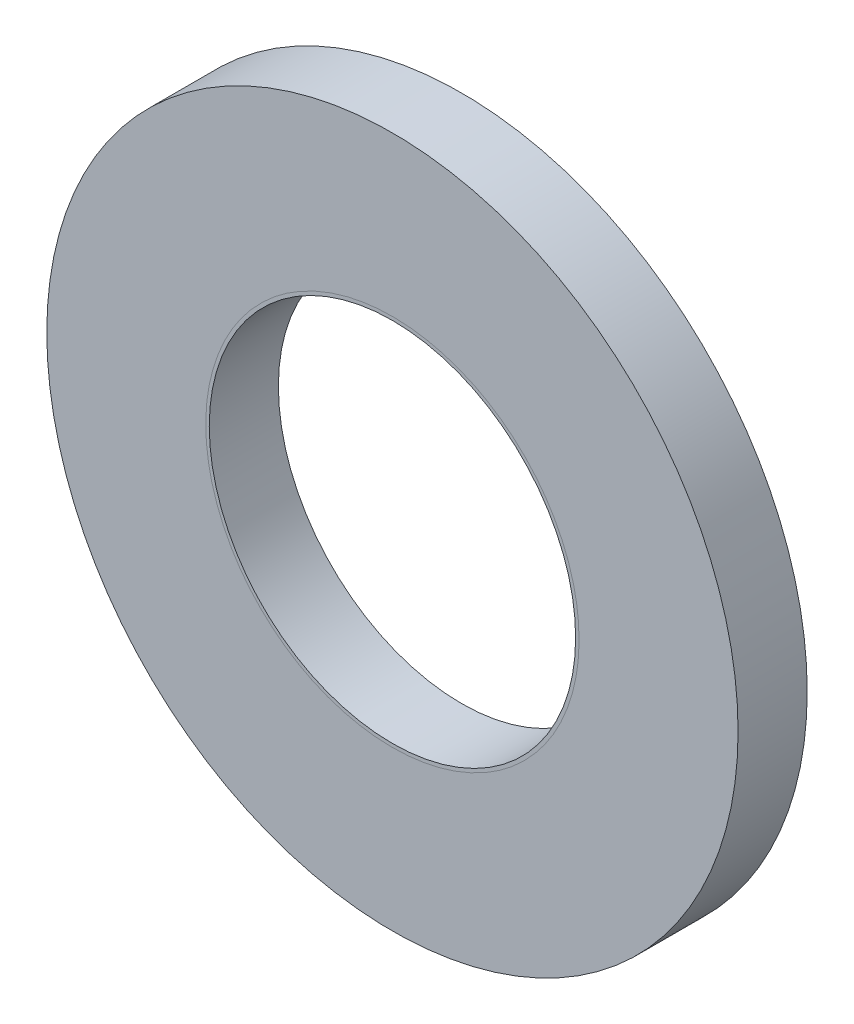
ISO-10303-21;
HEADER;
FILE_DESCRIPTION(('STEP AP214'),'2;1');
FILE_NAME('part.step','',(''),(''),'','','');
FILE_SCHEMA(('AUTOMOTIVE_DESIGN { 1 0 10303 214 1 1 1 1 }'));
ENDSEC;
DATA;
#1=APPLICATION_CONTEXT('core data for automotive mechanical design processes');
#2=APPLICATION_PROTOCOL_DEFINITION('international standard','automotive_design',2000,#1);
#3=PRODUCT_CONTEXT('',#1,'mechanical');
#4=PRODUCT('Part','Part','',(#3));
#5=PRODUCT_RELATED_PRODUCT_CATEGORY('part','',(#4));
#6=PRODUCT_DEFINITION_FORMATION('','',#4);
#7=PRODUCT_DEFINITION_CONTEXT('part definition',#1,'design');
#8=PRODUCT_DEFINITION('design','',#6,#7);
#9=PRODUCT_DEFINITION_SHAPE('','',#8);
#10=(LENGTH_UNIT() NAMED_UNIT(*) SI_UNIT(.MILLI.,.METRE.));
#11=(NAMED_UNIT(*) PLANE_ANGLE_UNIT() SI_UNIT($,.RADIAN.));
#12=(NAMED_UNIT(*) SI_UNIT($,.STERADIAN.) SOLID_ANGLE_UNIT());
#13=UNCERTAINTY_MEASURE_WITH_UNIT(LENGTH_MEASURE(1.E-05),#10,'distance_accuracy_value','');
#14=(GEOMETRIC_REPRESENTATION_CONTEXT(3) GLOBAL_UNCERTAINTY_ASSIGNED_CONTEXT((#13)) GLOBAL_UNIT_ASSIGNED_CONTEXT((#10,
#11,#12)) REPRESENTATION_CONTEXT('',''));
#15=CARTESIAN_POINT('',(0.,0.,0.));
#16=DIRECTION('',(0.,0.,1.));
#17=DIRECTION('',(1.,0.,0.));
#18=AXIS2_PLACEMENT_3D('',#15,#16,#17);
#19=CARTESIAN_POINT('',(0.,0.,1.1));
#20=DIRECTION('',(0.,0.,1.));
#21=DIRECTION('',(1.,0.,0.));
#22=AXIS2_PLACEMENT_3D('',#19,#20,#21);
#23=PLANE('',#22);
#24=CARTESIAN_POINT('',(-2.68972517592187,-0.235326322378775,1.09997841221976));
#25=CARTESIAN_POINT('',(-2.68600440242709,-0.277887764364603,1.09997841023913));
#26=CARTESIAN_POINT('',(-2.68130196476585,-0.320365171708397,1.09997840825841));
#27=CARTESIAN_POINT('',(-2.66994925084259,-0.404776140324443,1.09997840431423));
#28=CARTESIAN_POINT('',(-2.66331189641072,-0.446711441626157,1.09997840235073));
#29=CARTESIAN_POINT('',(-2.6480900029687,-0.530038714857837,1.09997839844096));
#30=CARTESIAN_POINT('',(-2.6395140874529,-0.571432259202987,1.09997839649464));
#31=CARTESIAN_POINT('',(-2.6204204341527,-0.653676066761412,1.09997839261927));
#32=CARTESIAN_POINT('',(-2.60990687901935,-0.694527300785542,1.09997839069017));
#33=CARTESIAN_POINT('',(-2.58694219375293,-0.775687236262533,1.09997838684921));
#34=CARTESIAN_POINT('',(-2.57449081215858,-0.815995866566043,1.09997838493735));
#35=CARTESIAN_POINT('',(-2.5476549853053,-0.896071649945949,1.09997838113081));
#36=CARTESIAN_POINT('',(-2.53326597805442,-0.935837273511998,1.0999783792362));
#37=CARTESIAN_POINT('',(-2.50255919675527,-1.01482878773208,1.0999783754641));
#38=CARTESIAN_POINT('',(-2.48623278873031,-1.05405132077825,1.09997837358674));
#39=CARTESIAN_POINT('',(-2.4516551065583,-1.13195776724211,1.09997836984911));
#40=CARTESIAN_POINT('',(-2.43339146441594,-1.17063618307302,1.09997836798905));
#41=CARTESIAN_POINT('',(-2.3935132174612,-1.25031708410015,1.09997836414806));
#42=CARTESIAN_POINT('',(-2.37174610289514,-1.29124335591321,1.09997836217003));
#43=CARTESIAN_POINT('',(-2.32633190468705,-1.37163070220461,1.09997835827405));
#44=CARTESIAN_POINT('',(-2.30270034380542,-1.41110053978221,1.09997835635575));
#45=CARTESIAN_POINT('',(-2.25356222362503,-1.4885767108033,1.09997835257916));
#46=CARTESIAN_POINT('',(-2.22806573611798,-1.52658942855752,1.09997835072062));
#47=CARTESIAN_POINT('',(-2.17520346993483,-1.60115394635506,1.09997834706346));
#48=CARTESIAN_POINT('',(-2.14784237419531,-1.63770906556622,1.0999783452647));
#49=CARTESIAN_POINT('',(-2.09125625312868,-1.70936156558717,1.09997834172698));
#50=CARTESIAN_POINT('',(-2.06203077135774,-1.74445858592174,1.09997833998803));
#51=CARTESIAN_POINT('',(-2.0017211287124,-1.81319880055702,1.09997833656976));
#52=CARTESIAN_POINT('',(-1.9706317901331,-1.84683745087662,1.09997833489063));
#53=CARTESIAN_POINT('',(-1.90659861244646,-1.91266481129962,1.09997833159183));
#54=CARTESIAN_POINT('',(-1.87364543197635,-1.94484443020998,1.09997832997255));
#55=CARTESIAN_POINT('',(-1.80589032088828,-2.00775977736999,1.09997832679321));
#56=CARTESIAN_POINT('',(-1.77107556573347,-2.03848168127963,1.09997832523373));
#57=CARTESIAN_POINT('',(-1.70002824719523,-2.09811642933317,1.09997832219259));
#58=CARTESIAN_POINT('',(-1.66379813928482,-2.12703219851057,1.0999783207108));
#59=CARTESIAN_POINT('',(-1.59019282137698,-2.18277087096662,1.09997831783926));
#60=CARTESIAN_POINT('',(-1.55282839079024,-2.20960799423028,1.09997831644889));
#61=CARTESIAN_POINT('',(-1.4769604296734,-2.26119470146773,1.09997831375995));
#62=CARTESIAN_POINT('',(-1.43846360541522,-2.28595414421612,1.09997831246096));
#63=CARTESIAN_POINT('',(-1.36033451016601,-2.33338966654442,1.0999783099546));
#64=CARTESIAN_POINT('',(-1.32070521928903,-2.35607065308044,1.09997830874701));
#65=CARTESIAN_POINT('',(-1.24031499359229,-2.39935439398233,1.09997830642326));
#66=CARTESIAN_POINT('',(-1.19955378304278,-2.41995663621232,1.09997830530711));
#67=CARTESIAN_POINT('',(-1.11690295815023,-2.45908869355478,1.09997830316595));
#68=CARTESIAN_POINT('',(-1.07501039645535,-2.47761228161771,1.09997830214123));
#69=CARTESIAN_POINT('',(-0.990099116819804,-2.51259165821764,1.09997830018272));
#70=CARTESIAN_POINT('',(-0.947075435967371,-2.52903538909286,1.09997829924948));
#71=CARTESIAN_POINT('',(-0.859904996347562,-2.55986517342414,1.09997829747348));
#72=CARTESIAN_POINT('',(-0.81575195936713,-2.57423345862157,1.09997829663153));
#73=CARTESIAN_POINT('',(-0.730344736181416,-2.5997014034968,1.09997829511028));
#74=CARTESIAN_POINT('',(-0.689140998077284,-2.61097054414516,1.09997829442337));
#75=CARTESIAN_POINT('',(-0.606513595071295,-2.63149191069137,1.0999782931418));
#76=CARTESIAN_POINT('',(-0.565093034989126,-2.64075660725406,1.09997829254658));
#77=CARTESIAN_POINT('',(-0.482035492916084,-2.65727675212489,1.09997829144806));
#78=CARTESIAN_POINT('',(-0.440400172641557,-2.66454055120152,1.09997829094438));
#79=CARTESIAN_POINT('',(-0.356914036337795,-2.67706212127447,1.09997829002879));
#80=CARTESIAN_POINT('',(-0.315063819365893,-2.68232388315743,1.0999782896167));
#81=CARTESIAN_POINT('',(-0.231149022793373,-2.69084605416584,1.09997828888409));
#82=CARTESIAN_POINT('',(-0.189084389674092,-2.69410593619615,1.09997828856358));
#83=CARTESIAN_POINT('',(-0.104741315204051,-2.69862898418623,1.09997828801392));
#84=CARTESIAN_POINT('',(-0.0624626021682738,-2.69988707369687,1.099978287785));
#85=CARTESIAN_POINT('',(0.0223085074702332,-2.70041056062237,1.09997828741833));
#86=CARTESIAN_POINT('',(0.0648009610846119,-2.69966642114691,1.09997828728101));
#87=CARTESIAN_POINT('',(0.149999767942916,-2.69619191856139,1.09997828709725));
#88=CARTESIAN_POINT('',(0.192705554307764,-2.69344778195152,1.09997828705143));
#89=CARTESIAN_POINT('',(0.277870085786983,-2.68601004899264,1.09997828705084));
#90=CARTESIAN_POINT('',(0.320329136340919,-2.68131995241243,1.09997828709589));
#91=CARTESIAN_POINT('',(0.40470912716513,-2.66998513265859,1.09997828727844));
#92=CARTESIAN_POINT('',(0.446631772140297,-2.66335313779257,1.09997828741535));
#93=CARTESIAN_POINT('',(0.529938723417316,-2.6481408081846,1.09997828778131));
#94=CARTESIAN_POINT('',(0.571324558476903,-2.6395688522093,1.09997828800997));
#95=CARTESIAN_POINT('',(0.653558152701219,-2.62048049270148,1.09997828855927));
#96=CARTESIAN_POINT('',(0.694406824013564,-2.60996802053118,1.09997828887973));
#97=CARTESIAN_POINT('',(0.775566797398587,-2.58700327549276,1.09997828961239));
#98=CARTESIAN_POINT('',(0.815877955222623,-2.57455049285515,1.09997829002462));
#99=CARTESIAN_POINT('',(0.895963997067971,-2.54770956023395,1.09997829094063));
#100=CARTESIAN_POINT('',(0.935737264775804,-2.53331658965337,1.09997829144464));
#101=CARTESIAN_POINT('',(1.01474923764573,-2.50259951658344,1.099978292544));
#102=CARTESIAN_POINT('',(1.05398448634706,-2.48626652685788,1.09997829313978));
#103=CARTESIAN_POINT('',(1.13192170699492,-2.45167363007057,1.09997829442248));
#104=CARTESIAN_POINT('',(1.17061807429089,-2.43340111478925,1.09997829511001));
#105=CARTESIAN_POINT('',(1.25031659000728,-2.39351332008088,1.09997829663013));
#106=CARTESIAN_POINT('',(1.29124297378724,-2.37174642850081,1.09997829747003));
#107=CARTESIAN_POINT('',(1.37163040131962,-2.32633239208702,1.09997829924258));
#108=CARTESIAN_POINT('',(1.41110020924788,-2.30270077215774,1.09997830017448));
#109=CARTESIAN_POINT('',(1.48857635869076,-2.25356260900363,1.09997830213078));
#110=CARTESIAN_POINT('',(1.52658908432636,-2.22806613719264,1.09997830315469));
#111=CARTESIAN_POINT('',(1.60115360787774,-2.17520388246848,1.09997830529474));
#112=CARTESIAN_POINT('',(1.63770872498557,-2.14784278254013,1.09997830641066));
#113=CARTESIAN_POINT('',(1.70936122346613,-2.09125665840574,1.09997830873445));
#114=CARTESIAN_POINT('',(1.74445824436427,-2.06203117775717,1.09997830994236));
#115=CARTESIAN_POINT('',(1.8131984594136,-2.0017215359364,1.09997831244989));
#116=CARTESIAN_POINT('',(1.84683710958159,-1.97063219705513,1.09997831374976));
#117=CARTESIAN_POINT('',(1.91266446989286,-1.90659901914594,1.09997831644102));
#118=CARTESIAN_POINT('',(1.94484408884417,-1.87364583875737,1.09997831783287));
#119=CARTESIAN_POINT('',(2.00775943603444,-1.80589072772949,1.09997832070778));
#120=CARTESIAN_POINT('',(2.03848133993296,-1.7710759725525,1.09997832219149));
#121=CARTESIAN_POINT('',(2.09811608797838,-1.70002865399799,1.0999783252317));
#122=CARTESIAN_POINT('',(2.12703185715878,-1.66379854609345,1.09997832678807));
#123=CARTESIAN_POINT('',(2.18277052961701,-1.59019322818982,1.09997832996216));
#124=CARTESIAN_POINT('',(2.2096076528799,-1.55282879760148,1.09997833157931));
#125=CARTESIAN_POINT('',(2.26119436011679,-1.47696083648343,1.09997833487467));
#126=CARTESIAN_POINT('',(2.2859538028654,-1.43846401222565,1.09997833655252));
#127=CARTESIAN_POINT('',(2.33338932519386,-1.36033491697671,1.09997833996907));
#128=CARTESIAN_POINT('',(2.35607031172982,-1.32070562609962,1.09997834170761));
#129=CARTESIAN_POINT('',(2.39935405263168,-1.2403154004028,1.09997834524537));
#130=CARTESIAN_POINT('',(2.41995629486168,-1.19955418985333,1.09997834704459));
#131=CARTESIAN_POINT('',(2.45908835220414,-1.11690336496083,1.09997835070351));
#132=CARTESIAN_POINT('',(2.47761194026706,-1.07501080326597,1.09997835256338));
#133=CARTESIAN_POINT('',(2.51259131686697,-0.990099523630469,1.09997835634348));
#134=CARTESIAN_POINT('',(2.52903504774219,-0.947075842778076,1.09997835826398));
#135=CARTESIAN_POINT('',(2.55986483207344,-0.859905403158359,1.09997836216518));
#136=CARTESIAN_POINT('',(2.57423311727085,-0.815752366177978,1.09997836414623));
#137=CARTESIAN_POINT('',(2.59970106214609,-0.730345142992226,1.09997836798766));
#138=CARTESIAN_POINT('',(2.61097020279448,-0.689141404888004,1.09997836984503));
#139=CARTESIAN_POINT('',(2.63149156934073,-0.606514001881861,1.09997837357806));
#140=CARTESIAN_POINT('',(2.64075626590344,-0.565093441799627,1.09997837545354));
#141=CARTESIAN_POINT('',(2.6572764107743,-0.482035899726483,1.09997837922261));
#142=CARTESIAN_POINT('',(2.66454020985095,-0.440400579451918,1.09997838111609));
#143=CARTESIAN_POINT('',(2.67706177992391,-0.356914443148105,1.0999783849211));
#144=CARTESIAN_POINT('',(2.68232354180688,-0.31506422617619,1.0999783868326));
#145=CARTESIAN_POINT('',(2.69084571281528,-0.23114942960367,1.09997839067357));
#146=CARTESIAN_POINT('',(2.69410559484559,-0.189084796484402,1.09997839260305));
#147=CARTESIAN_POINT('',(2.69862864283566,-0.104741722014412,1.09997839647996));
#148=CARTESIAN_POINT('',(2.69988673234628,-0.0624630089786744,1.09997839842742));
#149=CARTESIAN_POINT('',(2.70041021927176,0.0223081006597296,1.09997840234026));
#150=CARTESIAN_POINT('',(2.69966607979628,0.0648005542740444,1.09997840430567));
#151=CARTESIAN_POINT('',(2.69619157721071,0.149999361132194,1.09997840825442));
#152=CARTESIAN_POINT('',(2.6934474406008,0.192705147496952,1.09997841023777));
#153=CARTESIAN_POINT('',(2.68600970764185,0.277869678976357,1.09997841420094));
#154=CARTESIAN_POINT('',(2.68131961106157,0.320328729530568,1.09997841618076));
#155=CARTESIAN_POINT('',(2.66998479130763,0.40470872035525,1.09997842012344));
#156=CARTESIAN_POINT('',(2.66335279644158,0.446631365330613,1.09997842208633));
#157=CARTESIAN_POINT('',(2.64814046683354,0.529938316607946,1.09997842599513));
#158=CARTESIAN_POINT('',(2.63956851085821,0.57132415166765,1.09997842794107));
#159=CARTESIAN_POINT('',(2.62048015135035,0.653557745892124,1.09997843181595));
#160=CARTESIAN_POINT('',(2.60996767918005,0.69440641720451,1.09997843374492));
#161=CARTESIAN_POINT('',(2.58700293414164,0.775566390589533,1.09997843758589));
#162=CARTESIAN_POINT('',(2.57455015150403,0.81587754841353,1.09997843949787));
#163=CARTESIAN_POINT('',(2.54770921888286,0.895963590258721,1.0999784433049));
#164=CARTESIAN_POINT('',(2.53331624830231,0.935736857966436,1.09997844519989));
#165=CARTESIAN_POINT('',(2.50259917523245,1.01474883083604,1.09997844897297));
#166=CARTESIAN_POINT('',(2.48626618550693,1.05398407953719,1.09997845085095));
#167=CARTESIAN_POINT('',(2.45167328871972,1.13192130018457,1.09997845459006));
#168=CARTESIAN_POINT('',(2.43340077343845,1.17061766748026,1.09997845645098));
#169=CARTESIAN_POINT('',(2.39351297873004,1.25031618319643,1.09997846029283));
#170=CARTESIAN_POINT('',(2.37174608714985,1.29124256697643,1.09997846227086));
#171=CARTESIAN_POINT('',(2.32633205073587,1.37162999450889,1.09997846616684));
#172=CARTESIAN_POINT('',(2.30270043080651,1.41109980243719,1.09997846808514));
#173=CARTESIAN_POINT('',(2.25356226765228,1.48857595188012,1.09997847186172));
#174=CARTESIAN_POINT('',(2.22806579584124,1.52658867751574,1.09997847372026));
#175=CARTESIAN_POINT('',(2.17520354111702,1.60115320106715,1.09997847737743));
#176=CARTESIAN_POINT('',(2.14784244118865,1.63770831817499,1.09997847917619));
#177=CARTESIAN_POINT('',(2.09125631705426,1.70936081665555,1.09997848271391));
#178=CARTESIAN_POINT('',(2.06203083640571,1.74445783755368,1.09997848445286));
#179=CARTESIAN_POINT('',(2.001721194585,1.81319805260298,1.09997848787113));
#180=CARTESIAN_POINT('',(1.97063185570378,1.84683670277095,1.09997848955026));
#181=CARTESIAN_POINT('',(1.90659867779471,1.91266406308216,1.09997849284905));
#182=CARTESIAN_POINT('',(1.87364549740622,1.94484368203344,1.09997849446833));
#183=CARTESIAN_POINT('',(1.80589038637853,2.00775902922363,1.09997849764768));
#184=CARTESIAN_POINT('',(1.77107563120165,2.0384809331221,1.09997849920716));
#185=CARTESIAN_POINT('',(1.70002831264734,2.09811568116746,1.0999785022483));
#186=CARTESIAN_POINT('',(1.66379820474288,2.12703145034783,1.09997850373008));
#187=CARTESIAN_POINT('',(1.59019288683939,2.18277012280602,1.09997850660163));
#188=CARTESIAN_POINT('',(1.5528284562511,2.20960724606889,1.099978507992));
#189=CARTESIAN_POINT('',(1.47696049513316,2.26119395330576,1.09997851068094));
#190=CARTESIAN_POINT('',(1.4384636708754,2.28595339605435,1.09997851197993));
#191=CARTESIAN_POINT('',(1.36033457562652,2.3333889183828,1.09997851448629));
#192=CARTESIAN_POINT('',(1.32070528474943,2.35606990491876,1.09997851569387));
#193=CARTESIAN_POINT('',(1.24031505905261,2.39935364582061,1.09997851801763));
#194=CARTESIAN_POINT('',(1.19955384850313,2.41995588805062,1.09997851913378));
#195=CARTESIAN_POINT('',(1.11690302361058,2.4590879453931,1.09997852127494));
#196=CARTESIAN_POINT('',(1.07501046191568,2.47761153345602,1.09997852229966));
#197=CARTESIAN_POINT('',(0.990099182280092,2.51259091005596,1.09997852425817));
#198=CARTESIAN_POINT('',(0.94707550142764,2.52903464093119,1.09997852519141));
#199=CARTESIAN_POINT('',(0.859905061807782,2.55986442526249,1.0999785269674));
#200=CARTESIAN_POINT('',(0.815752024827321,2.57423271045993,1.09997852780936));
#201=CARTESIAN_POINT('',(0.730344801641563,2.59970065533517,1.09997852933061));
#202=CARTESIAN_POINT('',(0.689141063537418,2.61096979598353,1.09997853001752));
#203=CARTESIAN_POINT('',(0.606513660531406,2.63149116252975,1.09997853129909));
#204=CARTESIAN_POINT('',(0.565093100449226,2.64075585909243,1.09997853189431));
#205=CARTESIAN_POINT('',(0.482035558376169,2.65727600396327,1.09997853299283));
#206=CARTESIAN_POINT('',(0.440400238101637,2.66453980303991,1.09997853349651));
#207=CARTESIAN_POINT('',(0.356914101797868,2.67706137311286,1.0999785344121));
#208=CARTESIAN_POINT('',(0.315063884825964,2.68232313499582,1.09997853482419));
#209=CARTESIAN_POINT('',(0.231149088253444,2.69084530600423,1.0999785355568));
#210=CARTESIAN_POINT('',(0.189084455134165,2.69410518803453,1.09997853587731));
#211=CARTESIAN_POINT('',(0.104741380664131,2.69862823602462,1.09997853642696));
#212=CARTESIAN_POINT('',(0.0624626676283602,2.69988632553525,1.09997853665588));
#213=CARTESIAN_POINT('',(-0.0223084420101313,2.70040981246075,1.09997853702256));
#214=CARTESIAN_POINT('',(-0.0648008956245002,2.69966567298529,1.09997853715988));
#215=CARTESIAN_POINT('',(-0.14999970248278,2.69619117039976,1.09997853734364));
#216=CARTESIAN_POINT('',(-0.192705488847615,2.69344703378987,1.09997853738945));
#217=CARTESIAN_POINT('',(-0.277870020327062,2.68600930083098,1.09997853739005));
#218=CARTESIAN_POINT('',(-0.320329070881241,2.68131920425074,1.099978537345));
#219=CARTESIAN_POINT('',(-0.404709061705867,2.66998438449685,1.09997853716245));
#220=CARTESIAN_POINT('',(-0.446631706681208,2.66335238963082,1.09997853702554));
#221=CARTESIAN_POINT('',(-0.529938657958504,2.64814006002281,1.09997853665958));
#222=CARTESIAN_POINT('',(-0.571324493018194,2.63956810404751,1.09997853643092));
#223=CARTESIAN_POINT('',(-0.65355808724265,2.62047974453966,1.09997853588161));
#224=CARTESIAN_POINT('',(-0.694406758555031,2.60996727236937,1.09997853556116));
#225=CARTESIAN_POINT('',(-0.775566731940054,2.58700252733095,1.0999785348285));
#226=CARTESIAN_POINT('',(-0.815877889764055,2.57454974469334,1.09997853441627));
#227=CARTESIAN_POINT('',(-0.895963931609265,2.54770881207215,1.09997853350025));
#228=CARTESIAN_POINT('',(-0.935737199316995,2.53331584149159,1.09997853299625));
#229=CARTESIAN_POINT('',(-1.01474917218664,2.50259876842169,1.09997853189688));
#230=CARTESIAN_POINT('',(-1.05398442088781,2.48626577869615,1.0999785313011));
#231=CARTESIAN_POINT('',(-1.13192164153524,2.45167288190888,1.0999785300184));
#232=CARTESIAN_POINT('',(-1.17061800883097,2.43340036662757,1.09997852933088));
#233=CARTESIAN_POINT('',(-1.25031652454738,2.39351257191901,1.09997852781076));
#234=CARTESIAN_POINT('',(-1.29124290832758,2.37174568033871,1.09997852697086));
#235=CARTESIAN_POINT('',(-1.37163033586038,2.32633164392452,1.09997852519831));
#236=CARTESIAN_POINT('',(-1.41110014378882,2.30270002399508,1.09997852426641));
#237=CARTESIAN_POINT('',(-1.488576293232,2.25356186084071,1.09997852231011));
#238=CARTESIAN_POINT('',(-1.52658901886772,2.22806538902963,1.0999785212862));
#239=CARTESIAN_POINT('',(-1.60115354241922,2.17520313430533,1.09997851914615));
#240=CARTESIAN_POINT('',(-1.63770865952705,2.14784203437694,1.09997851803023));
#241=CARTESIAN_POINT('',(-1.7093611580077,2.09125591024257,1.09997851570643));
#242=CARTESIAN_POINT('',(-1.74445817890592,2.06203042959408,1.09997851449853));
#243=CARTESIAN_POINT('',(-1.81319839395478,2.00172078777334,1.099978511991));
#244=CARTESIAN_POINT('',(-1.84683704412222,1.97063144889204,1.09997851069113));
#245=CARTESIAN_POINT('',(-1.91266440443443,1.90659827098347,1.09997850799987));
#246=CARTESIAN_POINT('',(-1.94484402338726,1.87364509059558,1.09997850660802));
#247=CARTESIAN_POINT('',(-2.00775937057246,1.8058899795667,1.09997850373311));
#248=CARTESIAN_POINT('',(-2.03848127446434,1.77107522438801,1.0999785022494));
#249=CARTESIAN_POINT('',(-2.09811602252686,1.70002790583898,1.09997849920919));
#250=CARTESIAN_POINT('',(-2.12703179173095,1.66379779794158,1.09997849765282));
#251=CARTESIAN_POINT('',(-2.18277046412436,1.59019248001857,1.09997849447873));
#252=CARTESIAN_POINT('',(-2.20960758729958,1.55282804940394,1.09997849286157));
#253=CARTESIAN_POINT('',(-2.26119429477545,1.47696008835767,1.09997848956622));
#254=CARTESIAN_POINT('',(-2.2859537378486,1.4384632641973,1.09997848788837));
#255=CARTESIAN_POINT('',(-2.33338925929049,1.36033416868231,1.09997848447182));
#256=CARTESIAN_POINT('',(-2.35607024461907,1.32070487744286,1.09997848273327));
#257=CARTESIAN_POINT('',(-2.39935398882153,1.24031465273662,1.09997847919552));
#258=CARTESIAN_POINT('',(-2.41995623556093,1.1995534435405,1.0999784773963));
#259=CARTESIAN_POINT('',(-2.45908828056567,1.11690261494519,1.09997847373738));
#260=CARTESIAN_POINT('',(-2.47761185171907,1.07501004817543,1.09997847187751));
#261=CARTESIAN_POINT('',(-2.51259127462216,0.990098782436375,1.09997846809741));
#262=CARTESIAN_POINT('',(-2.52903506915566,0.947075120689038,1.09997846617691));
#263=CARTESIAN_POINT('',(-2.55986467903472,0.85990462871277,1.09997846227571));
#264=CARTESIAN_POINT('',(-2.57423272367026,0.815751519535072,1.09997846029465));
#265=CARTESIAN_POINT('',(-2.59970702746828,0.730325274066588,1.09997845645237));
#266=CARTESIAN_POINT('',(-2.61098180308535,0.689102298563496,1.09997845459414));
#267=CARTESIAN_POINT('',(-2.63151283311382,0.606441914949298,1.09997845085962));
#268=CARTESIAN_POINT('',(-2.64078181500663,0.565007675862126,1.09997844898353));
#269=CARTESIAN_POINT('',(-2.65730855397519,0.481928179856724,1.09997844521347));
#270=CARTESIAN_POINT('',(-2.66457492915117,0.440284638150804,1.09997844331962));
#271=CARTESIAN_POINT('',(-2.67709976902477,0.356787494768197,1.09997843951411));
#272=CARTESIAN_POINT('',(-2.68236249475921,0.314934532817133,1.09997843760249));
#273=CARTESIAN_POINT('',(-2.69088466084803,0.231019715505182,1.09997843376152));
#274=CARTESIAN_POINT('',(-2.69414384117215,0.188957833743453,1.09997843183216));
#275=CARTESIAN_POINT('',(-2.69866365547265,0.104625645919261,1.09997842795574));
#276=CARTESIAN_POINT('',(-2.69991947097785,0.0623550819046926,1.09997842600865));
#277=CARTESIAN_POINT('',(-2.70043625173286,-0.022393953699108,1.09997842209681));
#278=CARTESIAN_POINT('',(-2.69968792177555,-0.0648724788010867,1.09997842013202));
#279=CARTESIAN_POINT('',(-2.6962041660878,-0.150039065817644,1.09997841618473));
#280=CARTESIAN_POINT('',(-2.69345519659559,-0.19272657601528,1.0999784142022));
#281=CARTESIAN_POINT('',(-2.68972517592187,-0.235326322378775,1.09997841221976));
#282=B_SPLINE_CURVE_WITH_KNOTS('',3,(#24,#25,#26,#27,#28,#29,#30,#31,#32,#33,#34,#35,#36,#37,
#38,#39,#40,#41,#42,#43,#44,#45,#46,#47,#48,#49,#50,#51,#52,#53,#54,#55,#56,#57,#58,#59,#60,#61,
#62,#63,#64,#65,#66,#67,#68,#69,#70,#71,#72,#73,#74,#75,#76,#77,#78,#79,#80,#81,#82,#83,#84,#85,
#86,#87,#88,#89,#90,#91,#92,#93,#94,#95,#96,#97,#98,#99,#100,#101,#102,#103,#104,#105,#106,#107,
#108,#109,#110,#111,#112,#113,#114,#115,#116,#117,#118,#119,#120,#121,#122,#123,#124,#125,#126,
#127,#128,#129,#130,#131,#132,#133,#134,#135,#136,#137,#138,#139,#140,#141,#142,#143,#144,#145,
#146,#147,#148,#149,#150,#151,#152,#153,#154,#155,#156,#157,#158,#159,#160,#161,#162,#163,#164,
#165,#166,#167,#168,#169,#170,#171,#172,#173,#174,#175,#176,#177,#178,#179,#180,#181,#182,#183,
#184,#185,#186,#187,#188,#189,#190,#191,#192,#193,#194,#195,#196,#197,#198,#199,#200,#201,#202,
#203,#204,#205,#206,#207,#208,#209,#210,#211,#212,#213,#214,#215,#216,#217,#218,#219,#220,#221,
#222,#223,#224,#225,#226,#227,#228,#229,#230,#231,#232,#233,#234,#235,#236,#237,#238,#239,#240,
#241,#242,#243,#244,#245,#246,#247,#248,#249,#250,#251,#252,#253,#254,#255,#256,#257,#258,#259,
#260,#261,#262,#263,#264,#265,#266,#267,#268,#269,#270,#271,#272,#273,#274,#275,#276,#277,#278,
#279,#280,#281),.UNSPECIFIED.,.F.,.F.,(4,2,2,2,2,2,2,2,2,2,2,2,2,2,2,2,2,2,2,2,2,2,2,2,2,2,2,2,
2,2,2,2,2,2,2,2,2,2,2,2,2,2,2,2,2,2,2,2,2,2,2,2,2,2,2,2,2,2,2,2,2,2,2,2,2,2,2,2,2,2,2,2,2,2,2,2,
2,2,2,2,2,2,2,2,2,2,2,2,2,2,2,2,2,2,2,2,2,2,2,2,2,2,2,2,2,2,2,2,2,2,2,2,2,2,2,2,2,2,2,2,2,2,2,2,
2,2,2,2,4),(0.,0.128162595838292,0.255488166951852,0.382258116210694,0.508757554545793,
0.635273421738065,0.762092546053131,0.889499707629625,1.01777577023769,1.1567813965332,
1.29473198062754,1.43198588909148,1.56890695887909,1.70586167964997,1.84321627170126,
1.98133377457551,2.12057126043817,2.25957706949646,2.39752774752967,2.53478168996586,
2.67170276352763,2.80865748810085,2.94601211418647,3.08412971103025,3.2233673795516,
3.35147350182347,3.47875810336838,3.60550314261302,3.73199418621523,3.85851852065646,
3.9853632062203,4.11281313859199,4.24114918272255,4.36925541079188,4.49654006820778,
4.62328512895435,4.74977617567565,4.87630051106014,5.00314521160045,5.13059518897457,
5.25893132370289,5.39793694999835,5.53588753409265,5.67314144255656,5.81006251234415,
5.94701723311505,6.08437182516637,6.22248932804067,6.36172681390341,6.50073262296186,
6.63868330099518,6.77593724343143,6.91285831699323,7.04981304156642,7.18716766765198,
7.32528526449564,7.46452293301683,7.59262905528898,7.71991365683409,7.84665869607885,
7.97314973968109,8.09967407412229,8.22651875968601,8.35396869205751,8.4823047361878,
8.61041096425797,8.73769562167448,8.8644406824214,8.99093172914282,9.1174560645272,
9.24430076506714,9.37175074244067,9.50008687716817,9.63909250346392,9.77704308755842,
9.91429699602247,10.0512180658101,10.188172786581,10.3255273786321,10.4636448815062,
10.6028823673686,10.7418881764268,10.8798388544599,11.0170927968961,11.1540138704579,
11.2909685950311,11.4283232211167,11.5664408179606,11.705678486482,11.833784608754,
11.9610692102989,12.0878142495435,12.2143052931458,12.340829627587,12.4676743131508,
12.5951242455225,12.723460289653,12.8515665177231,12.9788511751395,13.1055962358864,
13.2320872826078,13.3586116179921,13.4854563185322,13.6129062959058,13.7412424306334,
13.8802480569298,14.0181986410249,14.1554525494892,14.2923736192769,14.4293283400477,
14.5666829320986,14.7048004349722,14.8440379208339,14.9830437298922,15.1209944079254,
15.2582483503615,15.3951694239233,15.5321241484965,15.6694787745821,15.8075963714259,
15.9468340399472,16.0750002982619,16.2023277606187,16.3290984024327,16.4555979227381,
16.582113857327,16.7089336303444,16.8363426096485,16.9646222309541),.UNSPECIFIED.);
#283=CARTESIAN_POINT('',(-2.68972517592187,-0.235326322378775,1.09997841221976));
#284=VERTEX_POINT('',#283);
#285=EDGE_CURVE('E38',#284,#284,#282,.T.);
#286=ORIENTED_EDGE('',*,*,#285,.F.);
#287=EDGE_LOOP('',(#286));
#288=FACE_BOUND('',#287,.T.);
#289=CARTESIAN_POINT('',(0.,0.,1.1));
#290=DIRECTION('',(0.,0.,-1.));
#291=DIRECTION('',(-1.,0.,0.));
#292=AXIS2_PLACEMENT_3D('',#289,#290,#291);
#293=CIRCLE('',#292,5.);
#294=CARTESIAN_POINT('',(-5.,0.,1.1));
#295=VERTEX_POINT('',#294);
#296=EDGE_CURVE('E19',#295,#295,#293,.T.);
#297=ORIENTED_EDGE('',*,*,#296,.F.);
#298=EDGE_LOOP('',(#297));
#299=FACE_BOUND('',#298,.T.);
#300=ADVANCED_FACE('F15',(#288,#299),#23,.T.);
#301=CARTESIAN_POINT('',(10.0860717384532,3.3449090095478,1.09997852594638));
#302=DIRECTION('',(4.04029452445734E-09,-4.6182607216144E-08,0.999999999999999));
#303=DIRECTION('',(0.,-0.999999999999999,-4.6182607216144E-08));
#304=AXIS2_PLACEMENT_3D('',#301,#302,#303);
#305=PLANE('',#304);
#306=CARTESIAN_POINT('',(0.,0.,1.09997854021043));
#307=DIRECTION('',(0.,0.,-1.));
#308=DIRECTION('',(-1.,0.,0.));
#309=AXIS2_PLACEMENT_3D('',#306,#307,#308);
#310=CIRCLE('',#309,2.65);
#311=CARTESIAN_POINT('',(-2.65,0.,1.09997854021043));
#312=VERTEX_POINT('',#311);
#313=EDGE_CURVE('E28',#312,#312,#310,.T.);
#314=ORIENTED_EDGE('',*,*,#313,.T.);
#315=EDGE_LOOP('',(#314));
#316=FACE_BOUND('',#315,.T.);
#317=ORIENTED_EDGE('',*,*,#285,.T.);
#318=EDGE_LOOP('',(#317));
#319=FACE_BOUND('',#318,.T.);
#320=ADVANCED_FACE('F45',(#316,#319),#305,.T.);
#321=CARTESIAN_POINT('',(0.,0.,1.1));
#322=DIRECTION('',(0.,0.,-1.));
#323=DIRECTION('',(-1.,0.,0.));
#324=AXIS2_PLACEMENT_3D('',#321,#322,#323);
#325=CYLINDRICAL_SURFACE('',#324,5.);
#326=ORIENTED_EDGE('',*,*,#296,.T.);
#327=EDGE_LOOP('',(#326));
#328=FACE_BOUND('',#327,.T.);
#329=CARTESIAN_POINT('',(0.,0.,0.1));
#330=DIRECTION('',(0.,0.,-1.));
#331=DIRECTION('',(-1.,0.,0.));
#332=AXIS2_PLACEMENT_3D('',#329,#330,#331);
#333=CIRCLE('',#332,5.);
#334=CARTESIAN_POINT('',(-5.,0.,0.1));
#335=VERTEX_POINT('',#334);
#336=EDGE_CURVE('E23',#335,#335,#333,.F.);
#337=ORIENTED_EDGE('',*,*,#336,.T.);
#338=EDGE_LOOP('',(#337));
#339=FACE_BOUND('',#338,.T.);
#340=ADVANCED_FACE('F58',(#328,#339),#325,.T.);
#341=CARTESIAN_POINT('',(0.,0.,1.1));
#342=DIRECTION('',(0.,0.,-1.));
#343=DIRECTION('',(-1.,0.,0.));
#344=AXIS2_PLACEMENT_3D('',#341,#342,#343);
#345=CYLINDRICAL_SURFACE('',#344,2.65);
#346=CARTESIAN_POINT('',(0.,0.,0.1));
#347=DIRECTION('',(0.,0.,-1.));
#348=DIRECTION('',(-1.,0.,0.));
#349=AXIS2_PLACEMENT_3D('',#346,#347,#348);
#350=CIRCLE('',#349,2.65);
#351=CARTESIAN_POINT('',(-2.65,0.,0.1));
#352=VERTEX_POINT('',#351);
#353=EDGE_CURVE('E10',#352,#352,#350,.T.);
#354=ORIENTED_EDGE('',*,*,#353,.T.);
#355=EDGE_LOOP('',(#354));
#356=FACE_BOUND('',#355,.T.);
#357=ORIENTED_EDGE('',*,*,#313,.F.);
#358=EDGE_LOOP('',(#357));
#359=FACE_BOUND('',#358,.T.);
#360=ADVANCED_FACE('F61',(#356,#359),#345,.F.);
#361=CARTESIAN_POINT('',(0.,0.,0.1));
#362=DIRECTION('',(0.,0.,1.));
#363=DIRECTION('',(1.,0.,0.));
#364=AXIS2_PLACEMENT_3D('',#361,#362,#363);
#365=PLANE('',#364);
#366=ORIENTED_EDGE('',*,*,#353,.F.);
#367=EDGE_LOOP('',(#366));
#368=FACE_BOUND('',#367,.T.);
#369=ORIENTED_EDGE('',*,*,#336,.F.);
#370=EDGE_LOOP('',(#369));
#371=FACE_BOUND('',#370,.T.);
#372=ADVANCED_FACE('F64',(#368,#371),#365,.F.);
#373=CLOSED_SHELL('',(#300,#320,#340,#360,#372));
#374=MANIFOLD_SOLID_BREP('B1',#373);
#375=ADVANCED_BREP_SHAPE_REPRESENTATION('',(#18,#374),#14);
#376=SHAPE_DEFINITION_REPRESENTATION(#9,#375);
ENDSEC;
END-ISO-10303-21;
